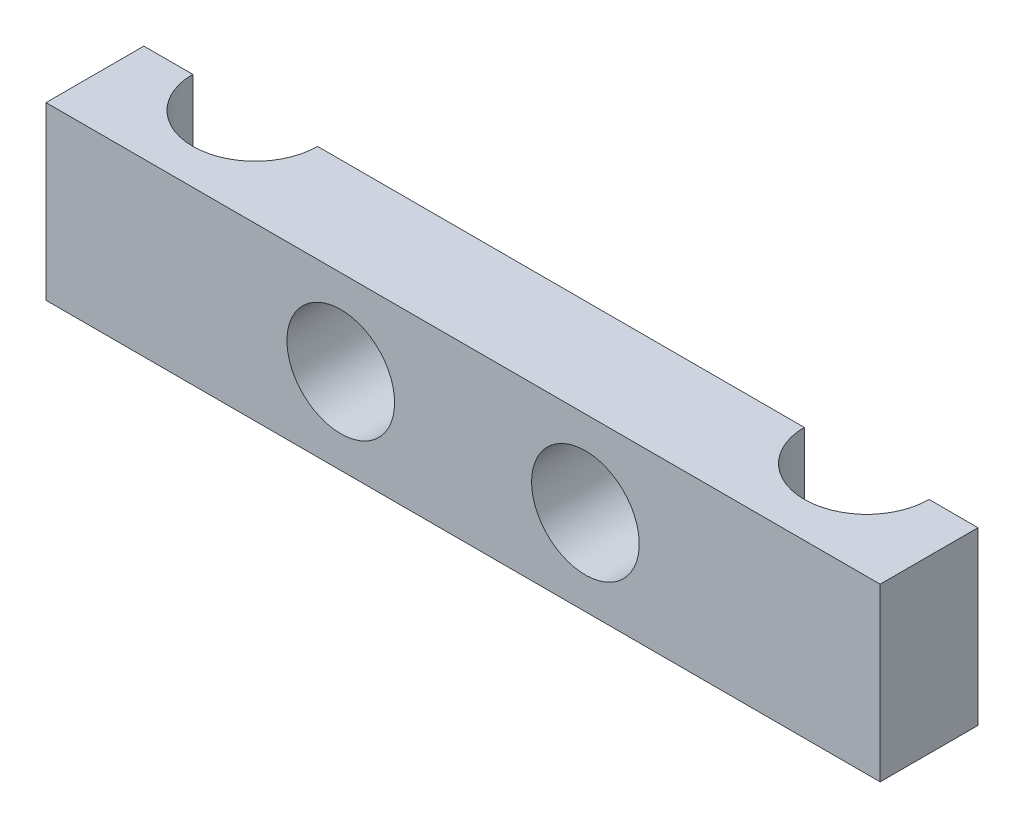
ISO-10303-21;
HEADER;
FILE_DESCRIPTION(('STEP AP214'),'2;1');
FILE_NAME('part.step','',(''),(''),'','','');
FILE_SCHEMA(('AUTOMOTIVE_DESIGN { 1 0 10303 214 1 1 1 1 }'));
ENDSEC;
DATA;
#1=APPLICATION_CONTEXT('core data for automotive mechanical design processes');
#2=APPLICATION_PROTOCOL_DEFINITION('international standard','automotive_design',2000,#1);
#3=PRODUCT_CONTEXT('',#1,'mechanical');
#4=PRODUCT('Part','Part','',(#3));
#5=PRODUCT_RELATED_PRODUCT_CATEGORY('part','',(#4));
#6=PRODUCT_DEFINITION_FORMATION('','',#4);
#7=PRODUCT_DEFINITION_CONTEXT('part definition',#1,'design');
#8=PRODUCT_DEFINITION('design','',#6,#7);
#9=PRODUCT_DEFINITION_SHAPE('','',#8);
#10=(LENGTH_UNIT() NAMED_UNIT(*) SI_UNIT(.MILLI.,.METRE.));
#11=(NAMED_UNIT(*) PLANE_ANGLE_UNIT() SI_UNIT($,.RADIAN.));
#12=(NAMED_UNIT(*) SI_UNIT($,.STERADIAN.) SOLID_ANGLE_UNIT());
#13=UNCERTAINTY_MEASURE_WITH_UNIT(LENGTH_MEASURE(1.E-05),#10,'distance_accuracy_value','');
#14=(GEOMETRIC_REPRESENTATION_CONTEXT(3) GLOBAL_UNCERTAINTY_ASSIGNED_CONTEXT((#13)) GLOBAL_UNIT_ASSIGNED_CONTEXT((#10,
#11,#12)) REPRESENTATION_CONTEXT('',''));
#15=CARTESIAN_POINT('',(0.,0.,0.));
#16=DIRECTION('',(0.,0.,1.));
#17=DIRECTION('',(1.,0.,0.));
#18=AXIS2_PLACEMENT_3D('',#15,#16,#17);
#19=CARTESIAN_POINT('',(0.,7.,-4.));
#20=DIRECTION('',(0.,0.,1.));
#21=DIRECTION('',(1.,0.,0.));
#22=AXIS2_PLACEMENT_3D('',#19,#20,#21);
#23=PLANE('',#22);
#24=CARTESIAN_POINT('',(-5.,3.5,-4.));
#25=DIRECTION('',(0.,0.,1.));
#26=DIRECTION('',(1.,0.,0.));
#27=AXIS2_PLACEMENT_3D('',#24,#25,#26);
#28=CIRCLE('',#27,2.2);
#29=CARTESIAN_POINT('',(-2.8,3.5,-4.));
#30=VERTEX_POINT('',#29);
#31=EDGE_CURVE('E129',#30,#30,#28,.F.);
#32=ORIENTED_EDGE('',*,*,#31,.F.);
#33=EDGE_LOOP('',(#32));
#34=FACE_BOUND('',#33,.T.);
#35=DIRECTION('',(-1.,0.,0.));
#36=VECTOR('',#35,1.);
#37=CARTESIAN_POINT('',(0.,0.,-4.));
#38=LINE('',#37,#36);
#39=CARTESIAN_POINT('',(9.95,0.,-4.));
#40=VERTEX_POINT('',#39);
#41=CARTESIAN_POINT('',(-9.95,0.,-4.));
#42=VERTEX_POINT('',#41);
#43=EDGE_CURVE('E136',#40,#42,#38,.T.);
#44=ORIENTED_EDGE('',*,*,#43,.T.);
#45=DIRECTION('',(0.,-1.,0.));
#46=VECTOR('',#45,1.);
#47=CARTESIAN_POINT('',(-9.95,7.,-4.));
#48=LINE('',#47,#46);
#49=CARTESIAN_POINT('',(-9.95,7.,-4.));
#50=VERTEX_POINT('',#49);
#51=EDGE_CURVE('E11',#50,#42,#48,.T.);
#52=ORIENTED_EDGE('',*,*,#51,.F.);
#53=DIRECTION('',(-1.,0.,0.));
#54=VECTOR('',#53,1.);
#55=CARTESIAN_POINT('',(0.,7.,-4.));
#56=LINE('',#55,#54);
#57=CARTESIAN_POINT('',(9.95,7.,-4.));
#58=VERTEX_POINT('',#57);
#59=EDGE_CURVE('E79',#58,#50,#56,.T.);
#60=ORIENTED_EDGE('',*,*,#59,.F.);
#61=DIRECTION('',(0.,-1.,0.));
#62=VECTOR('',#61,1.);
#63=CARTESIAN_POINT('',(9.95,7.,-4.));
#64=LINE('',#63,#62);
#65=EDGE_CURVE('E106',#58,#40,#64,.T.);
#66=ORIENTED_EDGE('',*,*,#65,.T.);
#67=EDGE_LOOP('',(#44,#52,#60,#66));
#68=FACE_BOUND('',#67,.T.);
#69=CARTESIAN_POINT('',(5.,3.5,-4.));
#70=DIRECTION('',(0.,0.,-1.));
#71=DIRECTION('',(-1.,0.,0.));
#72=AXIS2_PLACEMENT_3D('',#69,#70,#71);
#73=CIRCLE('',#72,2.2);
#74=CARTESIAN_POINT('',(2.8,3.5,-4.));
#75=VERTEX_POINT('',#74);
#76=EDGE_CURVE('E182',#75,#75,#73,.F.);
#77=ORIENTED_EDGE('',*,*,#76,.T.);
#78=EDGE_LOOP('',(#77));
#79=FACE_BOUND('',#78,.T.);
#80=ADVANCED_FACE('F32',(#34,#68,#79),#23,.F.);
#81=CARTESIAN_POINT('',(-12.5,7.,-4.));
#82=DIRECTION('',(0.,-1.,0.));
#83=DIRECTION('',(0.,0.,-1.));
#84=AXIS2_PLACEMENT_3D('',#81,#82,#83);
#85=CYLINDRICAL_SURFACE('',#84,2.55);
#86=CARTESIAN_POINT('',(-12.5,0.,-4.));
#87=DIRECTION('',(0.,-1.,0.));
#88=DIRECTION('',(0.,0.,1.));
#89=AXIS2_PLACEMENT_3D('',#86,#87,#88);
#90=CIRCLE('',#89,2.55);
#91=CARTESIAN_POINT('',(-15.05,0.,-3.99999999999999));
#92=VERTEX_POINT('',#91);
#93=EDGE_CURVE('E146',#42,#92,#90,.T.);
#94=ORIENTED_EDGE('',*,*,#93,.T.);
#95=DIRECTION('',(0.,-1.,0.));
#96=VECTOR('',#95,1.);
#97=CARTESIAN_POINT('',(-15.05,7.,-3.99999999999999));
#98=LINE('',#97,#96);
#99=CARTESIAN_POINT('',(-15.05,7.,-3.99999999999999));
#100=VERTEX_POINT('',#99);
#101=EDGE_CURVE('E40',#100,#92,#98,.T.);
#102=ORIENTED_EDGE('',*,*,#101,.F.);
#103=CARTESIAN_POINT('',(-12.5,7.,-4.));
#104=DIRECTION('',(0.,-1.,0.));
#105=DIRECTION('',(0.,0.,1.));
#106=AXIS2_PLACEMENT_3D('',#103,#104,#105);
#107=CIRCLE('',#106,2.55);
#108=EDGE_CURVE('E108',#50,#100,#107,.T.);
#109=ORIENTED_EDGE('',*,*,#108,.F.);
#110=ORIENTED_EDGE('',*,*,#51,.T.);
#111=EDGE_LOOP('',(#94,#102,#109,#110));
#112=FACE_BOUND('',#111,.T.);
#113=ADVANCED_FACE('F202',(#112),#85,.F.);
#114=CARTESIAN_POINT('',(-17.05,7.,-4.));
#115=DIRECTION('',(0.,0.,1.));
#116=DIRECTION('',(1.,0.,0.));
#117=AXIS2_PLACEMENT_3D('',#114,#115,#116);
#118=PLANE('',#117);
#119=DIRECTION('',(-1.,0.,0.));
#120=VECTOR('',#119,1.);
#121=CARTESIAN_POINT('',(-17.05,0.,-4.));
#122=LINE('',#121,#120);
#123=CARTESIAN_POINT('',(-17.05,0.,-4.));
#124=VERTEX_POINT('',#123);
#125=EDGE_CURVE('E66',#92,#124,#122,.T.);
#126=ORIENTED_EDGE('',*,*,#125,.T.);
#127=DIRECTION('',(0.,-1.,0.));
#128=VECTOR('',#127,1.);
#129=CARTESIAN_POINT('',(-17.05,7.,-4.));
#130=LINE('',#129,#128);
#131=CARTESIAN_POINT('',(-17.05,7.,-4.));
#132=VERTEX_POINT('',#131);
#133=EDGE_CURVE('E152',#132,#124,#130,.T.);
#134=ORIENTED_EDGE('',*,*,#133,.F.);
#135=DIRECTION('',(-1.,0.,0.));
#136=VECTOR('',#135,1.);
#137=CARTESIAN_POINT('',(-17.05,7.,-4.));
#138=LINE('',#137,#136);
#139=EDGE_CURVE('E139',#100,#132,#138,.T.);
#140=ORIENTED_EDGE('',*,*,#139,.F.);
#141=ORIENTED_EDGE('',*,*,#101,.T.);
#142=EDGE_LOOP('',(#126,#134,#140,#141));
#143=FACE_BOUND('',#142,.T.);
#144=ADVANCED_FACE('F155',(#143),#118,.F.);
#145=CARTESIAN_POINT('',(-17.05,7.,0.));
#146=DIRECTION('',(1.,0.,0.));
#147=DIRECTION('',(0.,0.,-1.));
#148=AXIS2_PLACEMENT_3D('',#145,#146,#147);
#149=PLANE('',#148);
#150=DIRECTION('',(0.,0.,1.));
#151=VECTOR('',#150,1.);
#152=CARTESIAN_POINT('',(-17.05,0.,0.));
#153=LINE('',#152,#151);
#154=CARTESIAN_POINT('',(-17.05,0.,0.));
#155=VERTEX_POINT('',#154);
#156=EDGE_CURVE('E72',#124,#155,#153,.T.);
#157=ORIENTED_EDGE('',*,*,#156,.T.);
#158=DIRECTION('',(0.,-1.,0.));
#159=VECTOR('',#158,1.);
#160=CARTESIAN_POINT('',(-17.05,7.,0.));
#161=LINE('',#160,#159);
#162=CARTESIAN_POINT('',(-17.05,7.,0.));
#163=VERTEX_POINT('',#162);
#164=EDGE_CURVE('E144',#163,#155,#161,.T.);
#165=ORIENTED_EDGE('',*,*,#164,.F.);
#166=DIRECTION('',(0.,0.,1.));
#167=VECTOR('',#166,1.);
#168=CARTESIAN_POINT('',(-17.05,7.,0.));
#169=LINE('',#168,#167);
#170=EDGE_CURVE('E48',#132,#163,#169,.T.);
#171=ORIENTED_EDGE('',*,*,#170,.F.);
#172=ORIENTED_EDGE('',*,*,#133,.T.);
#173=EDGE_LOOP('',(#157,#165,#171,#172));
#174=FACE_BOUND('',#173,.T.);
#175=ADVANCED_FACE('F216',(#174),#149,.F.);
#176=CARTESIAN_POINT('',(0.,7.,0.));
#177=DIRECTION('',(0.,0.,-1.));
#178=DIRECTION('',(-1.,0.,0.));
#179=AXIS2_PLACEMENT_3D('',#176,#177,#178);
#180=PLANE('',#179);
#181=CARTESIAN_POINT('',(-5.,3.5,0.));
#182=DIRECTION('',(0.,0.,1.));
#183=DIRECTION('',(1.,0.,0.));
#184=AXIS2_PLACEMENT_3D('',#181,#182,#183);
#185=CIRCLE('',#184,2.2);
#186=CARTESIAN_POINT('',(-2.8,3.5,0.));
#187=VERTEX_POINT('',#186);
#188=EDGE_CURVE('E125',#187,#187,#185,.T.);
#189=ORIENTED_EDGE('',*,*,#188,.F.);
#190=EDGE_LOOP('',(#189));
#191=FACE_BOUND('',#190,.T.);
#192=DIRECTION('',(1.,0.,0.));
#193=VECTOR('',#192,1.);
#194=CARTESIAN_POINT('',(0.,0.,0.));
#195=LINE('',#194,#193);
#196=CARTESIAN_POINT('',(17.05,0.,0.));
#197=VERTEX_POINT('',#196);
#198=EDGE_CURVE('E109',#155,#197,#195,.T.);
#199=ORIENTED_EDGE('',*,*,#198,.T.);
#200=DIRECTION('',(0.,-1.,0.));
#201=VECTOR('',#200,1.);
#202=CARTESIAN_POINT('',(17.05,7.,0.));
#203=LINE('',#202,#201);
#204=CARTESIAN_POINT('',(17.05,7.,0.));
#205=VERTEX_POINT('',#204);
#206=EDGE_CURVE('E169',#205,#197,#203,.T.);
#207=ORIENTED_EDGE('',*,*,#206,.F.);
#208=DIRECTION('',(1.,0.,0.));
#209=VECTOR('',#208,1.);
#210=CARTESIAN_POINT('',(0.,7.,0.));
#211=LINE('',#210,#209);
#212=EDGE_CURVE('E142',#163,#205,#211,.T.);
#213=ORIENTED_EDGE('',*,*,#212,.F.);
#214=ORIENTED_EDGE('',*,*,#164,.T.);
#215=EDGE_LOOP('',(#199,#207,#213,#214));
#216=FACE_BOUND('',#215,.T.);
#217=CARTESIAN_POINT('',(5.,3.5,0.));
#218=DIRECTION('',(0.,0.,-1.));
#219=DIRECTION('',(-1.,0.,0.));
#220=AXIS2_PLACEMENT_3D('',#217,#218,#219);
#221=CIRCLE('',#220,2.2);
#222=CARTESIAN_POINT('',(2.8,3.5,0.));
#223=VERTEX_POINT('',#222);
#224=EDGE_CURVE('E187',#223,#223,#221,.T.);
#225=ORIENTED_EDGE('',*,*,#224,.T.);
#226=EDGE_LOOP('',(#225));
#227=FACE_BOUND('',#226,.T.);
#228=ADVANCED_FACE('F166',(#191,#216,#227),#180,.F.);
#229=CARTESIAN_POINT('',(-12.5,7.,-4.));
#230=DIRECTION('',(0.,1.,0.));
#231=DIRECTION('',(0.,0.,1.));
#232=AXIS2_PLACEMENT_3D('',#229,#230,#231);
#233=PLANE('',#232);
#234=ORIENTED_EDGE('',*,*,#212,.T.);
#235=DIRECTION('',(0.,0.,1.));
#236=VECTOR('',#235,1.);
#237=CARTESIAN_POINT('',(17.05,7.,0.));
#238=LINE('',#237,#236);
#239=CARTESIAN_POINT('',(17.05,7.,-4.));
#240=VERTEX_POINT('',#239);
#241=EDGE_CURVE('E175',#240,#205,#238,.T.);
#242=ORIENTED_EDGE('',*,*,#241,.F.);
#243=DIRECTION('',(1.,0.,0.));
#244=VECTOR('',#243,1.);
#245=CARTESIAN_POINT('',(17.05,7.,-4.));
#246=LINE('',#245,#244);
#247=CARTESIAN_POINT('',(15.05,7.,-3.99999999999999));
#248=VERTEX_POINT('',#247);
#249=EDGE_CURVE('E115',#248,#240,#246,.T.);
#250=ORIENTED_EDGE('',*,*,#249,.F.);
#251=CARTESIAN_POINT('',(12.5,7.,-4.));
#252=DIRECTION('',(0.,1.,0.));
#253=DIRECTION('',(0.,0.,1.));
#254=AXIS2_PLACEMENT_3D('',#251,#252,#253);
#255=CIRCLE('',#254,2.55);
#256=EDGE_CURVE('E112',#58,#248,#255,.T.);
#257=ORIENTED_EDGE('',*,*,#256,.F.);
#258=ORIENTED_EDGE('',*,*,#59,.T.);
#259=ORIENTED_EDGE('',*,*,#108,.T.);
#260=ORIENTED_EDGE('',*,*,#139,.T.);
#261=ORIENTED_EDGE('',*,*,#170,.T.);
#262=EDGE_LOOP('',(#234,#242,#250,#257,#258,#259,#260,#261));
#263=FACE_BOUND('',#262,.T.);
#264=ADVANCED_FACE('F113',(#263),#233,.T.);
#265=CARTESIAN_POINT('',(-12.5,0.,-4.));
#266=DIRECTION('',(0.,1.,0.));
#267=DIRECTION('',(0.,0.,1.));
#268=AXIS2_PLACEMENT_3D('',#265,#266,#267);
#269=PLANE('',#268);
#270=ORIENTED_EDGE('',*,*,#43,.F.);
#271=CARTESIAN_POINT('',(12.5,0.,-4.));
#272=DIRECTION('',(0.,1.,0.));
#273=DIRECTION('',(0.,0.,1.));
#274=AXIS2_PLACEMENT_3D('',#271,#272,#273);
#275=CIRCLE('',#274,2.55);
#276=CARTESIAN_POINT('',(15.05,0.,-3.99999999999999));
#277=VERTEX_POINT('',#276);
#278=EDGE_CURVE('E124',#40,#277,#275,.T.);
#279=ORIENTED_EDGE('',*,*,#278,.T.);
#280=DIRECTION('',(1.,0.,0.));
#281=VECTOR('',#280,1.);
#282=CARTESIAN_POINT('',(17.05,0.,-4.));
#283=LINE('',#282,#281);
#284=CARTESIAN_POINT('',(17.05,0.,-4.));
#285=VERTEX_POINT('',#284);
#286=EDGE_CURVE('E180',#277,#285,#283,.T.);
#287=ORIENTED_EDGE('',*,*,#286,.T.);
#288=DIRECTION('',(0.,0.,1.));
#289=VECTOR('',#288,1.);
#290=CARTESIAN_POINT('',(17.05,0.,0.));
#291=LINE('',#290,#289);
#292=EDGE_CURVE('E119',#285,#197,#291,.T.);
#293=ORIENTED_EDGE('',*,*,#292,.T.);
#294=ORIENTED_EDGE('',*,*,#198,.F.);
#295=ORIENTED_EDGE('',*,*,#156,.F.);
#296=ORIENTED_EDGE('',*,*,#125,.F.);
#297=ORIENTED_EDGE('',*,*,#93,.F.);
#298=EDGE_LOOP('',(#270,#279,#287,#293,#294,#295,#296,#297));
#299=FACE_BOUND('',#298,.T.);
#300=ADVANCED_FACE('F159',(#299),#269,.F.);
#301=CARTESIAN_POINT('',(-5.,3.5,-10.2225396744416));
#302=DIRECTION('',(0.,0.,1.));
#303=DIRECTION('',(1.,0.,0.));
#304=AXIS2_PLACEMENT_3D('',#301,#302,#303);
#305=CYLINDRICAL_SURFACE('',#304,2.2);
#306=ORIENTED_EDGE('',*,*,#31,.T.);
#307=EDGE_LOOP('',(#306));
#308=FACE_BOUND('',#307,.T.);
#309=ORIENTED_EDGE('',*,*,#188,.T.);
#310=EDGE_LOOP('',(#309));
#311=FACE_BOUND('',#310,.T.);
#312=ADVANCED_FACE('F209',(#308,#311),#305,.F.);
#313=CARTESIAN_POINT('',(12.5,7.,-4.));
#314=DIRECTION('',(0.,-1.,0.));
#315=DIRECTION('',(0.,0.,-1.));
#316=AXIS2_PLACEMENT_3D('',#313,#314,#315);
#317=CYLINDRICAL_SURFACE('',#316,2.55);
#318=ORIENTED_EDGE('',*,*,#278,.F.);
#319=ORIENTED_EDGE('',*,*,#65,.F.);
#320=ORIENTED_EDGE('',*,*,#256,.T.);
#321=DIRECTION('',(0.,-1.,0.));
#322=VECTOR('',#321,1.);
#323=CARTESIAN_POINT('',(15.05,7.,-3.99999999999999));
#324=LINE('',#323,#322);
#325=EDGE_CURVE('E126',#248,#277,#324,.T.);
#326=ORIENTED_EDGE('',*,*,#325,.T.);
#327=EDGE_LOOP('',(#318,#319,#320,#326));
#328=FACE_BOUND('',#327,.T.);
#329=ADVANCED_FACE('F122',(#328),#317,.F.);
#330=CARTESIAN_POINT('',(17.05,7.,-4.));
#331=DIRECTION('',(0.,0.,1.));
#332=DIRECTION('',(-1.,0.,0.));
#333=AXIS2_PLACEMENT_3D('',#330,#331,#332);
#334=PLANE('',#333);
#335=ORIENTED_EDGE('',*,*,#286,.F.);
#336=ORIENTED_EDGE('',*,*,#325,.F.);
#337=ORIENTED_EDGE('',*,*,#249,.T.);
#338=DIRECTION('',(0.,-1.,0.));
#339=VECTOR('',#338,1.);
#340=CARTESIAN_POINT('',(17.05,7.,-4.));
#341=LINE('',#340,#339);
#342=EDGE_CURVE('E131',#240,#285,#341,.T.);
#343=ORIENTED_EDGE('',*,*,#342,.T.);
#344=EDGE_LOOP('',(#335,#336,#337,#343));
#345=FACE_BOUND('',#344,.T.);
#346=ADVANCED_FACE('F198',(#345),#334,.F.);
#347=CARTESIAN_POINT('',(17.05,7.,0.));
#348=DIRECTION('',(-1.,0.,0.));
#349=DIRECTION('',(0.,0.,-1.));
#350=AXIS2_PLACEMENT_3D('',#347,#348,#349);
#351=PLANE('',#350);
#352=ORIENTED_EDGE('',*,*,#292,.F.);
#353=ORIENTED_EDGE('',*,*,#342,.F.);
#354=ORIENTED_EDGE('',*,*,#241,.T.);
#355=ORIENTED_EDGE('',*,*,#206,.T.);
#356=EDGE_LOOP('',(#352,#353,#354,#355));
#357=FACE_BOUND('',#356,.T.);
#358=ADVANCED_FACE('F172',(#357),#351,.F.);
#359=CARTESIAN_POINT('',(5.,3.5,-10.2225396744416));
#360=DIRECTION('',(0.,0.,1.));
#361=DIRECTION('',(-1.,0.,0.));
#362=AXIS2_PLACEMENT_3D('',#359,#360,#361);
#363=CYLINDRICAL_SURFACE('',#362,2.2);
#364=ORIENTED_EDGE('',*,*,#76,.F.);
#365=EDGE_LOOP('',(#364));
#366=FACE_BOUND('',#365,.T.);
#367=ORIENTED_EDGE('',*,*,#224,.F.);
#368=EDGE_LOOP('',(#367));
#369=FACE_BOUND('',#368,.T.);
#370=ADVANCED_FACE('F191',(#366,#369),#363,.F.);
#371=CLOSED_SHELL('',(#80,#113,#144,#175,#228,#264,#300,#312,#329,#346,#358,#370));
#372=MANIFOLD_SOLID_BREP('B2',#371);
#373=ADVANCED_BREP_SHAPE_REPRESENTATION('',(#18,#372),#14);
#374=SHAPE_DEFINITION_REPRESENTATION(#9,#373);
ENDSEC;
END-ISO-10303-21;
